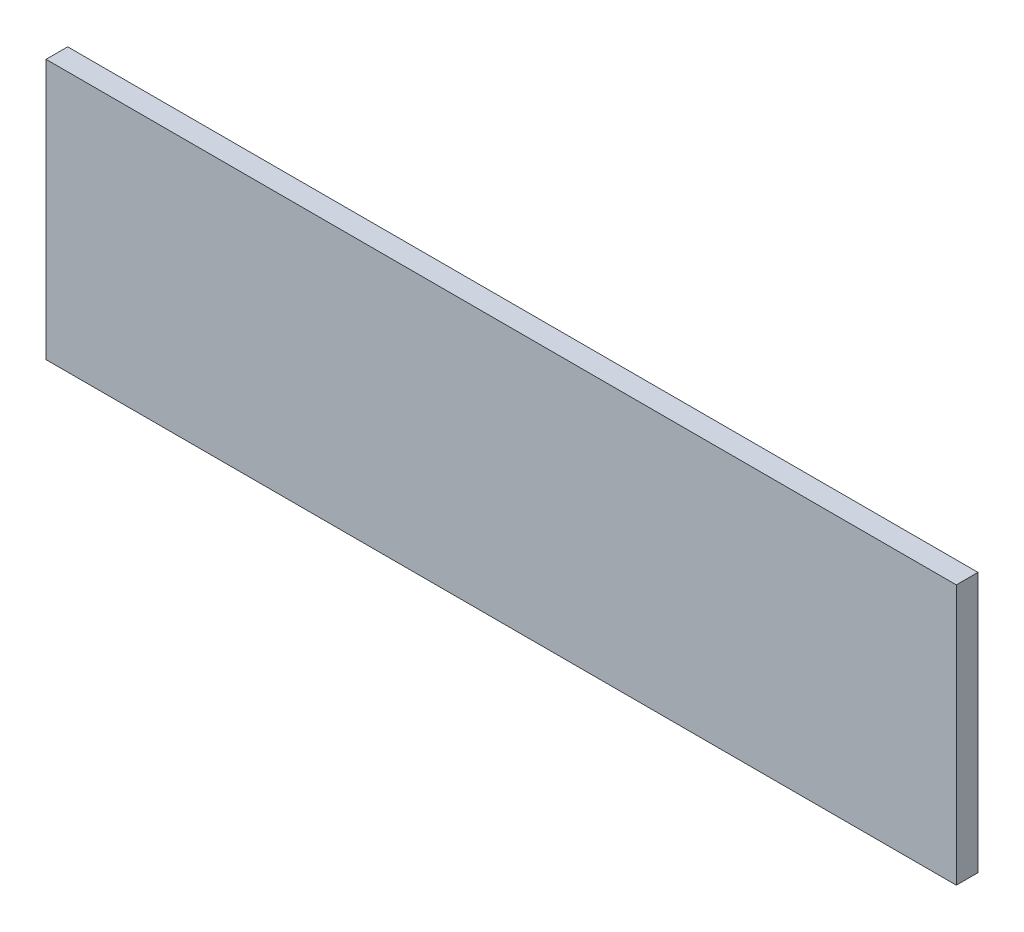
ISO-10303-21;
HEADER;
FILE_DESCRIPTION(('STEP AP214'),'2;1');
FILE_NAME('part.step','',(''),(''),'','','');
FILE_SCHEMA(('AUTOMOTIVE_DESIGN { 1 0 10303 214 1 1 1 1 }'));
ENDSEC;
DATA;
#1=APPLICATION_CONTEXT('core data for automotive mechanical design processes');
#2=APPLICATION_PROTOCOL_DEFINITION('international standard','automotive_design',2000,#1);
#3=PRODUCT_CONTEXT('',#1,'mechanical');
#4=PRODUCT('Part','Part','',(#3));
#5=PRODUCT_RELATED_PRODUCT_CATEGORY('part','',(#4));
#6=PRODUCT_DEFINITION_FORMATION('','',#4);
#7=PRODUCT_DEFINITION_CONTEXT('part definition',#1,'design');
#8=PRODUCT_DEFINITION('design','',#6,#7);
#9=PRODUCT_DEFINITION_SHAPE('','',#8);
#10=(LENGTH_UNIT() NAMED_UNIT(*) SI_UNIT(.MILLI.,.METRE.));
#11=(NAMED_UNIT(*) PLANE_ANGLE_UNIT() SI_UNIT($,.RADIAN.));
#12=(NAMED_UNIT(*) SI_UNIT($,.STERADIAN.) SOLID_ANGLE_UNIT());
#13=UNCERTAINTY_MEASURE_WITH_UNIT(LENGTH_MEASURE(1.E-05),#10,'distance_accuracy_value','');
#14=(GEOMETRIC_REPRESENTATION_CONTEXT(3) GLOBAL_UNCERTAINTY_ASSIGNED_CONTEXT((#13)) GLOBAL_UNIT_ASSIGNED_CONTEXT((#10,
#11,#12)) REPRESENTATION_CONTEXT('',''));
#15=CARTESIAN_POINT('',(0.,0.,0.));
#16=DIRECTION('',(0.,0.,1.));
#17=DIRECTION('',(1.,0.,0.));
#18=AXIS2_PLACEMENT_3D('',#15,#16,#17);
#19=CARTESIAN_POINT('',(-130.718421091845,35.3886762277968,6.35));
#20=DIRECTION('',(0.,0.,1.));
#21=DIRECTION('',(1.,0.,0.));
#22=AXIS2_PLACEMENT_3D('',#19,#20,#21);
#23=PLANE('',#22);
#24=DIRECTION('',(0.,1.,0.));
#25=VECTOR('',#24,1.);
#26=CARTESIAN_POINT('',(2.63157890815482,73.4886762277968,6.35));
#27=LINE('',#26,#25);
#28=CARTESIAN_POINT('',(2.63157890815481,73.4886762277968,6.35));
#29=VERTEX_POINT('',#28);
#30=CARTESIAN_POINT('',(2.63157890815482,-2.71132377220326,6.35));
#31=VERTEX_POINT('',#30);
#32=EDGE_CURVE('E68',#29,#31,#27,.F.);
#33=ORIENTED_EDGE('',*,*,#32,.F.);
#34=DIRECTION('',(1.,0.,0.));
#35=VECTOR('',#34,1.);
#36=CARTESIAN_POINT('',(-264.068421091845,73.4886762277968,6.35));
#37=LINE('',#36,#35);
#38=CARTESIAN_POINT('',(-264.068421091845,73.4886762277968,6.35));
#39=VERTEX_POINT('',#38);
#40=EDGE_CURVE('E20',#39,#29,#37,.T.);
#41=ORIENTED_EDGE('',*,*,#40,.F.);
#42=DIRECTION('',(0.,1.,0.));
#43=VECTOR('',#42,1.);
#44=CARTESIAN_POINT('',(-264.068421091845,-2.71132377220328,6.35));
#45=LINE('',#44,#43);
#46=CARTESIAN_POINT('',(-264.068421091845,-2.71132377220326,6.35));
#47=VERTEX_POINT('',#46);
#48=EDGE_CURVE('E58',#47,#39,#45,.T.);
#49=ORIENTED_EDGE('',*,*,#48,.F.);
#50=DIRECTION('',(1.,0.,0.));
#51=VECTOR('',#50,1.);
#52=CARTESIAN_POINT('',(2.63157890815485,-2.71132377220326,6.35));
#53=LINE('',#52,#51);
#54=EDGE_CURVE('E53',#31,#47,#53,.F.);
#55=ORIENTED_EDGE('',*,*,#54,.F.);
#56=EDGE_LOOP('',(#33,#41,#49,#55));
#57=FACE_BOUND('',#56,.T.);
#58=ADVANCED_FACE('F17',(#57),#23,.T.);
#59=CARTESIAN_POINT('',(-264.068421091845,73.4886762277968,0.));
#60=DIRECTION('',(0.,1.,0.));
#61=DIRECTION('',(0.,0.,1.));
#62=AXIS2_PLACEMENT_3D('',#59,#60,#61);
#63=PLANE('',#62);
#64=ORIENTED_EDGE('',*,*,#40,.T.);
#65=DIRECTION('',(0.,0.,-1.));
#66=VECTOR('',#65,1.);
#67=CARTESIAN_POINT('',(2.63157890815482,73.4886762277968,0.));
#68=LINE('',#67,#66);
#69=CARTESIAN_POINT('',(2.63157890815481,73.4886762277968,0.));
#70=VERTEX_POINT('',#69);
#71=EDGE_CURVE('E79',#70,#29,#68,.F.);
#72=ORIENTED_EDGE('',*,*,#71,.F.);
#73=DIRECTION('',(1.,0.,0.));
#74=VECTOR('',#73,1.);
#75=CARTESIAN_POINT('',(-130.718421091845,73.4886762277968,0.));
#76=LINE('',#75,#74);
#77=CARTESIAN_POINT('',(-264.068421091845,73.4886762277968,0.));
#78=VERTEX_POINT('',#77);
#79=EDGE_CURVE('E74',#70,#78,#76,.F.);
#80=ORIENTED_EDGE('',*,*,#79,.T.);
#81=DIRECTION('',(0.,0.,1.));
#82=VECTOR('',#81,1.);
#83=CARTESIAN_POINT('',(-264.068421091845,73.4886762277968,0.));
#84=LINE('',#83,#82);
#85=EDGE_CURVE('E63',#39,#78,#84,.F.);
#86=ORIENTED_EDGE('',*,*,#85,.F.);
#87=EDGE_LOOP('',(#64,#72,#80,#86));
#88=FACE_BOUND('',#87,.T.);
#89=ADVANCED_FACE('F73',(#88),#63,.T.);
#90=CARTESIAN_POINT('',(-264.068421091845,-2.71132377220328,0.));
#91=DIRECTION('',(-1.,0.,0.));
#92=DIRECTION('',(0.,0.,1.));
#93=AXIS2_PLACEMENT_3D('',#90,#91,#92);
#94=PLANE('',#93);
#95=ORIENTED_EDGE('',*,*,#48,.T.);
#96=ORIENTED_EDGE('',*,*,#85,.T.);
#97=DIRECTION('',(0.,1.,0.));
#98=VECTOR('',#97,1.);
#99=CARTESIAN_POINT('',(-264.068421091845,35.3886762277968,0.));
#100=LINE('',#99,#98);
#101=CARTESIAN_POINT('',(-264.068421091845,-2.71132377220326,0.));
#102=VERTEX_POINT('',#101);
#103=EDGE_CURVE('E84',#78,#102,#100,.F.);
#104=ORIENTED_EDGE('',*,*,#103,.T.);
#105=DIRECTION('',(0.,0.,-1.));
#106=VECTOR('',#105,1.);
#107=CARTESIAN_POINT('',(-264.068421091845,-2.71132377220326,0.));
#108=LINE('',#107,#106);
#109=EDGE_CURVE('E65',#47,#102,#108,.T.);
#110=ORIENTED_EDGE('',*,*,#109,.F.);
#111=EDGE_LOOP('',(#95,#96,#104,#110));
#112=FACE_BOUND('',#111,.T.);
#113=ADVANCED_FACE('F60',(#112),#94,.T.);
#114=CARTESIAN_POINT('',(2.63157890815485,-2.71132377220326,0.));
#115=DIRECTION('',(0.,-1.,0.));
#116=DIRECTION('',(0.,0.,-1.));
#117=AXIS2_PLACEMENT_3D('',#114,#115,#116);
#118=PLANE('',#117);
#119=ORIENTED_EDGE('',*,*,#54,.T.);
#120=ORIENTED_EDGE('',*,*,#109,.T.);
#121=DIRECTION('',(1.,0.,0.));
#122=VECTOR('',#121,1.);
#123=CARTESIAN_POINT('',(-130.718421091845,-2.71132377220326,0.));
#124=LINE('',#123,#122);
#125=CARTESIAN_POINT('',(2.63157890815482,-2.71132377220326,0.));
#126=VERTEX_POINT('',#125);
#127=EDGE_CURVE('E26',#102,#126,#124,.T.);
#128=ORIENTED_EDGE('',*,*,#127,.T.);
#129=DIRECTION('',(0.,0.,-1.));
#130=VECTOR('',#129,1.);
#131=CARTESIAN_POINT('',(2.63157890815482,-2.71132377220326,0.));
#132=LINE('',#131,#130);
#133=EDGE_CURVE('E34',#31,#126,#132,.T.);
#134=ORIENTED_EDGE('',*,*,#133,.F.);
#135=EDGE_LOOP('',(#119,#120,#128,#134));
#136=FACE_BOUND('',#135,.T.);
#137=ADVANCED_FACE('F88',(#136),#118,.T.);
#138=CARTESIAN_POINT('',(2.63157890815482,73.4886762277968,0.));
#139=DIRECTION('',(1.,0.,0.));
#140=DIRECTION('',(0.,0.,-1.));
#141=AXIS2_PLACEMENT_3D('',#138,#139,#140);
#142=PLANE('',#141);
#143=ORIENTED_EDGE('',*,*,#32,.T.);
#144=ORIENTED_EDGE('',*,*,#133,.T.);
#145=DIRECTION('',(0.,1.,0.));
#146=VECTOR('',#145,1.);
#147=CARTESIAN_POINT('',(2.63157890815482,35.3886762277968,0.));
#148=LINE('',#147,#146);
#149=EDGE_CURVE('E11',#126,#70,#148,.T.);
#150=ORIENTED_EDGE('',*,*,#149,.T.);
#151=ORIENTED_EDGE('',*,*,#71,.T.);
#152=EDGE_LOOP('',(#143,#144,#150,#151));
#153=FACE_BOUND('',#152,.T.);
#154=ADVANCED_FACE('F91',(#153),#142,.T.);
#155=CARTESIAN_POINT('',(-130.718421091845,35.3886762277968,0.));
#156=DIRECTION('',(0.,0.,1.));
#157=DIRECTION('',(1.,0.,0.));
#158=AXIS2_PLACEMENT_3D('',#155,#156,#157);
#159=PLANE('',#158);
#160=ORIENTED_EDGE('',*,*,#127,.F.);
#161=ORIENTED_EDGE('',*,*,#103,.F.);
#162=ORIENTED_EDGE('',*,*,#79,.F.);
#163=ORIENTED_EDGE('',*,*,#149,.F.);
#164=EDGE_LOOP('',(#160,#161,#162,#163));
#165=FACE_BOUND('',#164,.T.);
#166=ADVANCED_FACE('F90',(#165),#159,.F.);
#167=CLOSED_SHELL('',(#58,#89,#113,#137,#154,#166));
#168=MANIFOLD_SOLID_BREP('B1',#167);
#169=ADVANCED_BREP_SHAPE_REPRESENTATION('',(#18,#168),#14);
#170=SHAPE_DEFINITION_REPRESENTATION(#9,#169);
ENDSEC;
END-ISO-10303-21;
